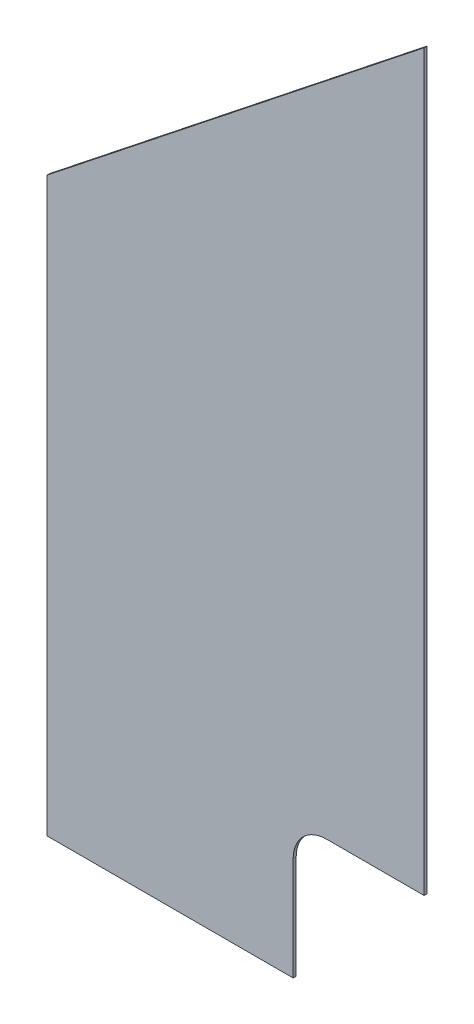
ISO-10303-21;
HEADER;
FILE_DESCRIPTION(('STEP AP214'),'2;1');
FILE_NAME('part.step','',(''),(''),'','','');
FILE_SCHEMA(('AUTOMOTIVE_DESIGN { 1 0 10303 214 1 1 1 1 }'));
ENDSEC;
DATA;
#1=APPLICATION_CONTEXT('core data for automotive mechanical design processes');
#2=APPLICATION_PROTOCOL_DEFINITION('international standard','automotive_design',2000,#1);
#3=PRODUCT_CONTEXT('',#1,'mechanical');
#4=PRODUCT('Part','Part','',(#3));
#5=PRODUCT_RELATED_PRODUCT_CATEGORY('part','',(#4));
#6=PRODUCT_DEFINITION_FORMATION('','',#4);
#7=PRODUCT_DEFINITION_CONTEXT('part definition',#1,'design');
#8=PRODUCT_DEFINITION('design','',#6,#7);
#9=PRODUCT_DEFINITION_SHAPE('','',#8);
#10=(LENGTH_UNIT() NAMED_UNIT(*) SI_UNIT(.MILLI.,.METRE.));
#11=(NAMED_UNIT(*) PLANE_ANGLE_UNIT() SI_UNIT($,.RADIAN.));
#12=(NAMED_UNIT(*) SI_UNIT($,.STERADIAN.) SOLID_ANGLE_UNIT());
#13=UNCERTAINTY_MEASURE_WITH_UNIT(LENGTH_MEASURE(1.E-05),#10,'distance_accuracy_value','');
#14=(GEOMETRIC_REPRESENTATION_CONTEXT(3) GLOBAL_UNCERTAINTY_ASSIGNED_CONTEXT((#13)) GLOBAL_UNIT_ASSIGNED_CONTEXT((#10,
#11,#12)) REPRESENTATION_CONTEXT('',''));
#15=CARTESIAN_POINT('',(0.,0.,0.));
#16=DIRECTION('',(0.,0.,1.));
#17=DIRECTION('',(1.,0.,0.));
#18=AXIS2_PLACEMENT_3D('',#15,#16,#17);
#19=CARTESIAN_POINT('',(-393.7,0.,3.175));
#20=DIRECTION('',(1.,0.,0.));
#21=DIRECTION('',(0.,0.,-1.));
#22=AXIS2_PLACEMENT_3D('',#19,#20,#21);
#23=PLANE('',#22);
#24=DIRECTION('',(0.,-1.,0.));
#25=VECTOR('',#24,1.);
#26=CARTESIAN_POINT('',(-393.7,0.,0.));
#27=LINE('',#26,#25);
#28=CARTESIAN_POINT('',(-393.7,596.9,0.));
#29=VERTEX_POINT('',#28);
#30=CARTESIAN_POINT('',(-393.7,0.,0.));
#31=VERTEX_POINT('',#30);
#32=EDGE_CURVE('E125',#29,#31,#27,.T.);
#33=ORIENTED_EDGE('',*,*,#32,.T.);
#34=DIRECTION('',(0.,0.,-1.));
#35=VECTOR('',#34,1.);
#36=CARTESIAN_POINT('',(-393.7,0.,3.175));
#37=LINE('',#36,#35);
#38=CARTESIAN_POINT('',(-393.7,0.,3.175));
#39=VERTEX_POINT('',#38);
#40=EDGE_CURVE('E11',#39,#31,#37,.T.);
#41=ORIENTED_EDGE('',*,*,#40,.F.);
#42=DIRECTION('',(0.,-1.,0.));
#43=VECTOR('',#42,1.);
#44=CARTESIAN_POINT('',(-393.7,0.,3.175));
#45=LINE('',#44,#43);
#46=CARTESIAN_POINT('',(-393.7,596.9,3.175));
#47=VERTEX_POINT('',#46);
#48=EDGE_CURVE('E122',#47,#39,#45,.T.);
#49=ORIENTED_EDGE('',*,*,#48,.F.);
#50=DIRECTION('',(0.,0.,-1.));
#51=VECTOR('',#50,1.);
#52=CARTESIAN_POINT('',(-393.7,596.9,3.175));
#53=LINE('',#52,#51);
#54=EDGE_CURVE('E129',#47,#29,#53,.T.);
#55=ORIENTED_EDGE('',*,*,#54,.T.);
#56=EDGE_LOOP('',(#33,#41,#49,#55));
#57=FACE_BOUND('',#56,.T.);
#58=ADVANCED_FACE('F32',(#57),#23,.F.);
#59=CARTESIAN_POINT('',(0.,0.,3.175));
#60=DIRECTION('',(0.,1.,0.));
#61=DIRECTION('',(-1.,0.,0.));
#62=AXIS2_PLACEMENT_3D('',#59,#60,#61);
#63=PLANE('',#62);
#64=DIRECTION('',(1.,0.,0.));
#65=VECTOR('',#64,1.);
#66=CARTESIAN_POINT('',(0.,0.,0.));
#67=LINE('',#66,#65);
#68=CARTESIAN_POINT('',(-136.652,0.,0.));
#69=VERTEX_POINT('',#68);
#70=EDGE_CURVE('E120',#31,#69,#67,.T.);
#71=ORIENTED_EDGE('',*,*,#70,.T.);
#72=DIRECTION('',(0.,0.,1.));
#73=VECTOR('',#72,1.);
#74=CARTESIAN_POINT('',(-136.652,0.,0.));
#75=LINE('',#74,#73);
#76=CARTESIAN_POINT('',(-136.652,0.,3.175));
#77=VERTEX_POINT('',#76);
#78=EDGE_CURVE('E136',#69,#77,#75,.T.);
#79=ORIENTED_EDGE('',*,*,#78,.T.);
#80=DIRECTION('',(1.,0.,0.));
#81=VECTOR('',#80,1.);
#82=CARTESIAN_POINT('',(0.,0.,3.175));
#83=LINE('',#82,#81);
#84=EDGE_CURVE('E78',#39,#77,#83,.T.);
#85=ORIENTED_EDGE('',*,*,#84,.F.);
#86=ORIENTED_EDGE('',*,*,#40,.T.);
#87=EDGE_LOOP('',(#71,#79,#85,#86));
#88=FACE_BOUND('',#87,.T.);
#89=ADVANCED_FACE('F149',(#88),#63,.F.);
#90=CARTESIAN_POINT('',(0.,908.942774900816,3.175));
#91=DIRECTION('',(-1.,0.,0.));
#92=DIRECTION('',(0.,-1.,0.));
#93=AXIS2_PLACEMENT_3D('',#90,#91,#92);
#94=PLANE('',#93);
#95=DIRECTION('',(0.,1.,0.));
#96=VECTOR('',#95,1.);
#97=CARTESIAN_POINT('',(0.,908.942774900816,3.175));
#98=LINE('',#97,#96);
#99=CARTESIAN_POINT('',(0.,142.875,3.175));
#100=VERTEX_POINT('',#99);
#101=CARTESIAN_POINT('',(0.,908.942774900816,3.175));
#102=VERTEX_POINT('',#101);
#103=EDGE_CURVE('E115',#100,#102,#98,.T.);
#104=ORIENTED_EDGE('',*,*,#103,.F.);
#105=DIRECTION('',(0.,0.,1.));
#106=VECTOR('',#105,1.);
#107=CARTESIAN_POINT('',(0.,142.875,0.));
#108=LINE('',#107,#106);
#109=CARTESIAN_POINT('',(0.,142.875,0.));
#110=VERTEX_POINT('',#109);
#111=EDGE_CURVE('E103',#110,#100,#108,.T.);
#112=ORIENTED_EDGE('',*,*,#111,.F.);
#113=DIRECTION('',(0.,1.,0.));
#114=VECTOR('',#113,1.);
#115=CARTESIAN_POINT('',(0.,908.942774900816,0.));
#116=LINE('',#115,#114);
#117=CARTESIAN_POINT('',(0.,908.942774900816,0.));
#118=VERTEX_POINT('',#117);
#119=EDGE_CURVE('E114',#110,#118,#116,.T.);
#120=ORIENTED_EDGE('',*,*,#119,.T.);
#121=DIRECTION('',(0.,0.,-1.));
#122=VECTOR('',#121,1.);
#123=CARTESIAN_POINT('',(0.,908.942774900816,3.175));
#124=LINE('',#123,#122);
#125=EDGE_CURVE('E39',#102,#118,#124,.T.);
#126=ORIENTED_EDGE('',*,*,#125,.F.);
#127=EDGE_LOOP('',(#104,#112,#120,#126));
#128=FACE_BOUND('',#127,.T.);
#129=ADVANCED_FACE('F112',(#128),#94,.F.);
#130=CARTESIAN_POINT('',(-393.7,596.9,3.175));
#131=DIRECTION('',(0.621147780278308,-0.783693457325841,0.));
#132=DIRECTION('',(0.783693457325841,0.621147780278308,0.));
#133=AXIS2_PLACEMENT_3D('',#130,#131,#132);
#134=PLANE('',#133);
#135=DIRECTION('',(-0.783693457325841,-0.621147780278309,0.));
#136=VECTOR('',#135,1.);
#137=CARTESIAN_POINT('',(-393.7,596.9,0.));
#138=LINE('',#137,#136);
#139=EDGE_CURVE('E72',#118,#29,#138,.T.);
#140=ORIENTED_EDGE('',*,*,#139,.T.);
#141=ORIENTED_EDGE('',*,*,#54,.F.);
#142=DIRECTION('',(-0.783693457325841,-0.621147780278309,0.));
#143=VECTOR('',#142,1.);
#144=CARTESIAN_POINT('',(-393.7,596.9,3.175));
#145=LINE('',#144,#143);
#146=EDGE_CURVE('E55',#102,#47,#145,.T.);
#147=ORIENTED_EDGE('',*,*,#146,.F.);
#148=ORIENTED_EDGE('',*,*,#125,.T.);
#149=EDGE_LOOP('',(#140,#141,#147,#148));
#150=FACE_BOUND('',#149,.T.);
#151=ADVANCED_FACE('F130',(#150),#134,.F.);
#152=CARTESIAN_POINT('',(0.,0.,3.175));
#153=DIRECTION('',(0.,0.,1.));
#154=DIRECTION('',(1.,0.,0.));
#155=AXIS2_PLACEMENT_3D('',#152,#153,#154);
#156=PLANE('',#155);
#157=DIRECTION('',(0.,-1.,0.));
#158=VECTOR('',#157,1.);
#159=CARTESIAN_POINT('',(-136.652,0.,3.175));
#160=LINE('',#159,#158);
#161=CARTESIAN_POINT('',(-136.652,107.95,3.175));
#162=VERTEX_POINT('',#161);
#163=EDGE_CURVE('E108',#162,#77,#160,.T.);
#164=ORIENTED_EDGE('',*,*,#163,.F.);
#165=CARTESIAN_POINT('',(-101.727,107.95,3.175));
#166=DIRECTION('',(0.,0.,1.));
#167=DIRECTION('',(1.,0.,0.));
#168=AXIS2_PLACEMENT_3D('',#165,#166,#167);
#169=CIRCLE('',#168,34.925);
#170=CARTESIAN_POINT('',(-101.727,142.875,3.175));
#171=VERTEX_POINT('',#170);
#172=EDGE_CURVE('E157',#171,#162,#169,.T.);
#173=ORIENTED_EDGE('',*,*,#172,.F.);
#174=DIRECTION('',(-1.,0.,0.));
#175=VECTOR('',#174,1.);
#176=CARTESIAN_POINT('',(0.,142.875,3.175));
#177=LINE('',#176,#175);
#178=EDGE_CURVE('E156',#100,#171,#177,.T.);
#179=ORIENTED_EDGE('',*,*,#178,.F.);
#180=ORIENTED_EDGE('',*,*,#103,.T.);
#181=ORIENTED_EDGE('',*,*,#146,.T.);
#182=ORIENTED_EDGE('',*,*,#48,.T.);
#183=ORIENTED_EDGE('',*,*,#84,.T.);
#184=EDGE_LOOP('',(#164,#173,#179,#180,#181,#182,#183));
#185=FACE_BOUND('',#184,.T.);
#186=ADVANCED_FACE('F147',(#185),#156,.T.);
#187=CARTESIAN_POINT('',(0.,0.,0.));
#188=DIRECTION('',(0.,0.,1.));
#189=DIRECTION('',(1.,0.,0.));
#190=AXIS2_PLACEMENT_3D('',#187,#188,#189);
#191=PLANE('',#190);
#192=CARTESIAN_POINT('',(-101.727,107.95,0.));
#193=DIRECTION('',(0.,0.,1.));
#194=DIRECTION('',(1.,0.,0.));
#195=AXIS2_PLACEMENT_3D('',#192,#193,#194);
#196=CIRCLE('',#195,34.925);
#197=CARTESIAN_POINT('',(-101.727,142.875,0.));
#198=VERTEX_POINT('',#197);
#199=CARTESIAN_POINT('',(-136.652,107.95,0.));
#200=VERTEX_POINT('',#199);
#201=EDGE_CURVE('E46',#198,#200,#196,.T.);
#202=ORIENTED_EDGE('',*,*,#201,.T.);
#203=DIRECTION('',(0.,-1.,0.));
#204=VECTOR('',#203,1.);
#205=CARTESIAN_POINT('',(-136.652,0.,0.));
#206=LINE('',#205,#204);
#207=EDGE_CURVE('E116',#200,#69,#206,.T.);
#208=ORIENTED_EDGE('',*,*,#207,.T.);
#209=ORIENTED_EDGE('',*,*,#70,.F.);
#210=ORIENTED_EDGE('',*,*,#32,.F.);
#211=ORIENTED_EDGE('',*,*,#139,.F.);
#212=ORIENTED_EDGE('',*,*,#119,.F.);
#213=DIRECTION('',(-1.,0.,0.));
#214=VECTOR('',#213,1.);
#215=CARTESIAN_POINT('',(0.,142.875,0.));
#216=LINE('',#215,#214);
#217=EDGE_CURVE('E99',#110,#198,#216,.T.);
#218=ORIENTED_EDGE('',*,*,#217,.T.);
#219=EDGE_LOOP('',(#202,#208,#209,#210,#211,#212,#218));
#220=FACE_BOUND('',#219,.T.);
#221=ADVANCED_FACE('F118',(#220),#191,.F.);
#222=CARTESIAN_POINT('',(-136.652,0.,0.));
#223=DIRECTION('',(-1.,0.,0.));
#224=DIRECTION('',(0.,-1.,0.));
#225=AXIS2_PLACEMENT_3D('',#222,#223,#224);
#226=PLANE('',#225);
#227=ORIENTED_EDGE('',*,*,#163,.T.);
#228=ORIENTED_EDGE('',*,*,#78,.F.);
#229=ORIENTED_EDGE('',*,*,#207,.F.);
#230=DIRECTION('',(0.,0.,1.));
#231=VECTOR('',#230,1.);
#232=CARTESIAN_POINT('',(-136.652,107.95,0.));
#233=LINE('',#232,#231);
#234=EDGE_CURVE('E139',#200,#162,#233,.T.);
#235=ORIENTED_EDGE('',*,*,#234,.T.);
#236=EDGE_LOOP('',(#227,#228,#229,#235));
#237=FACE_BOUND('',#236,.T.);
#238=ADVANCED_FACE('F159',(#237),#226,.F.);
#239=CARTESIAN_POINT('',(-101.727,107.95,0.));
#240=DIRECTION('',(0.,0.,1.));
#241=DIRECTION('',(1.,0.,0.));
#242=AXIS2_PLACEMENT_3D('',#239,#240,#241);
#243=CYLINDRICAL_SURFACE('',#242,34.925);
#244=ORIENTED_EDGE('',*,*,#172,.T.);
#245=ORIENTED_EDGE('',*,*,#234,.F.);
#246=ORIENTED_EDGE('',*,*,#201,.F.);
#247=DIRECTION('',(0.,0.,1.));
#248=VECTOR('',#247,1.);
#249=CARTESIAN_POINT('',(-101.727,142.875,0.));
#250=LINE('',#249,#248);
#251=EDGE_CURVE('E105',#198,#171,#250,.T.);
#252=ORIENTED_EDGE('',*,*,#251,.T.);
#253=EDGE_LOOP('',(#244,#245,#246,#252));
#254=FACE_BOUND('',#253,.T.);
#255=ADVANCED_FACE('F160',(#254),#243,.F.);
#256=CARTESIAN_POINT('',(0.,142.875,0.));
#257=DIRECTION('',(0.,1.,0.));
#258=DIRECTION('',(-1.,0.,0.));
#259=AXIS2_PLACEMENT_3D('',#256,#257,#258);
#260=PLANE('',#259);
#261=ORIENTED_EDGE('',*,*,#178,.T.);
#262=ORIENTED_EDGE('',*,*,#251,.F.);
#263=ORIENTED_EDGE('',*,*,#217,.F.);
#264=ORIENTED_EDGE('',*,*,#111,.T.);
#265=EDGE_LOOP('',(#261,#262,#263,#264));
#266=FACE_BOUND('',#265,.T.);
#267=ADVANCED_FACE('F102',(#266),#260,.F.);
#268=CLOSED_SHELL('',(#58,#89,#129,#151,#186,#221,#238,#255,#267));
#269=MANIFOLD_SOLID_BREP('B2',#268);
#270=ADVANCED_BREP_SHAPE_REPRESENTATION('',(#18,#269),#14);
#271=SHAPE_DEFINITION_REPRESENTATION(#9,#270);
ENDSEC;
END-ISO-10303-21;
